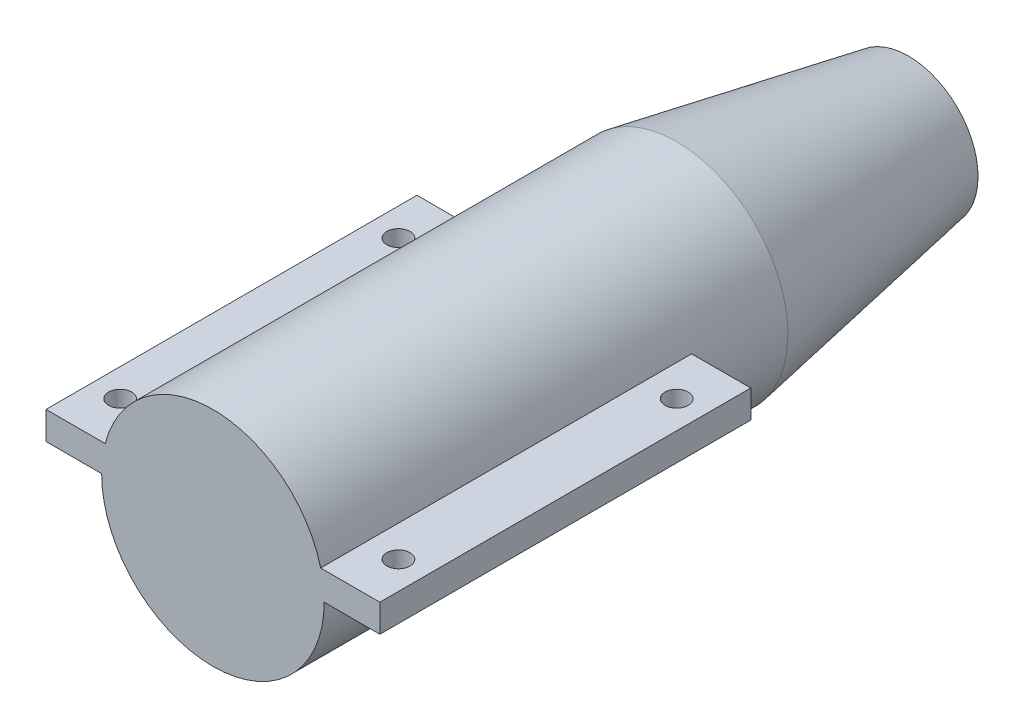
ISO-10303-21;
HEADER;
FILE_DESCRIPTION(('STEP AP214'),'2;1');
FILE_NAME('part.step','',(''),(''),'','','');
FILE_SCHEMA(('AUTOMOTIVE_DESIGN { 1 0 10303 214 1 1 1 1 }'));
ENDSEC;
DATA;
#1=APPLICATION_CONTEXT('core data for automotive mechanical design processes');
#2=APPLICATION_PROTOCOL_DEFINITION('international standard','automotive_design',2000,#1);
#3=PRODUCT_CONTEXT('',#1,'mechanical');
#4=PRODUCT('Part','Part','',(#3));
#5=PRODUCT_RELATED_PRODUCT_CATEGORY('part','',(#4));
#6=PRODUCT_DEFINITION_FORMATION('','',#4);
#7=PRODUCT_DEFINITION_CONTEXT('part definition',#1,'design');
#8=PRODUCT_DEFINITION('design','',#6,#7);
#9=PRODUCT_DEFINITION_SHAPE('','',#8);
#10=(LENGTH_UNIT() NAMED_UNIT(*) SI_UNIT(.MILLI.,.METRE.));
#11=(NAMED_UNIT(*) PLANE_ANGLE_UNIT() SI_UNIT($,.RADIAN.));
#12=(NAMED_UNIT(*) SI_UNIT($,.STERADIAN.) SOLID_ANGLE_UNIT());
#13=UNCERTAINTY_MEASURE_WITH_UNIT(LENGTH_MEASURE(1.E-05),#10,'distance_accuracy_value','');
#14=(GEOMETRIC_REPRESENTATION_CONTEXT(3) GLOBAL_UNCERTAINTY_ASSIGNED_CONTEXT((#13)) GLOBAL_UNIT_ASSIGNED_CONTEXT((#10,
#11,#12)) REPRESENTATION_CONTEXT('',''));
#15=CARTESIAN_POINT('',(0.,0.,0.));
#16=DIRECTION('',(0.,0.,1.));
#17=DIRECTION('',(1.,0.,0.));
#18=AXIS2_PLACEMENT_3D('',#15,#16,#17);
#19=CARTESIAN_POINT('',(0.,0.,70.));
#20=DIRECTION('',(0.,0.,1.));
#21=DIRECTION('',(1.,0.,0.));
#22=AXIS2_PLACEMENT_3D('',#19,#20,#21);
#23=PLANE('',#22);
#24=CARTESIAN_POINT('',(0.,15.,70.));
#25=CARTESIAN_POINT('',(-0.413936257442321,15.,70.));
#26=CARTESIAN_POINT('',(-1.23402152083851,14.9663936257442,70.));
#27=CARTESIAN_POINT('',(-2.43691479305229,14.8190378100084,70.));
#28=CARTESIAN_POINT('',(-3.6087005739705,14.5786086083354,70.));
#29=CARTESIAN_POINT('',(-10.4295331012156,12.6008302931655,70.));
#30=CARTESIAN_POINT('',(-15.,6.6229801190772,70.));
#31=CARTESIAN_POINT('',(-15.,-8.2787251488465,70.));
#32=CARTESIAN_POINT('',(-8.2787251488465,-15.,70.));
#33=CARTESIAN_POINT('',(8.2787251488465,-15.,70.));
#34=CARTESIAN_POINT('',(15.,-8.2787251488465,70.));
#35=CARTESIAN_POINT('',(15.,6.6229801190772,70.));
#36=CARTESIAN_POINT('',(10.4295331012156,12.6008302931655,70.));
#37=CARTESIAN_POINT('',(3.6087005739705,14.5786086083354,70.));
#38=CARTESIAN_POINT('',(2.4369147930523,14.8190378100084,70.));
#39=CARTESIAN_POINT('',(1.23402152083851,14.9663936257442,70.));
#40=CARTESIAN_POINT('',(0.413936257442326,15.,70.));
#41=CARTESIAN_POINT('',(0.,15.,70.));
#42=B_SPLINE_CURVE_WITH_KNOTS('',3,(#24,#25,#26,#27,#28,#29,#30,#31,#32,#33,#34,#35,#36,#37,#38,
#39,#40,#41),.UNSPECIFIED.,.T.,.F.,(4,1,1,1,1,2,2,2,1,1,1,1,4),(0.,0.0125,0.025,0.0375,0.05,
0.25,0.5,0.75,0.95,0.9625,0.975,0.9875,1.),.UNSPECIFIED.);
#43=CARTESIAN_POINT('',(0.,15.,70.));
#44=VERTEX_POINT('',#43);
#45=EDGE_CURVE('E219',#44,#44,#42,.T.);
#46=ORIENTED_EDGE('',*,*,#45,.F.);
#47=EDGE_LOOP('',(#46));
#48=FACE_BOUND('',#47,.T.);
#49=ADVANCED_FACE('F41',(#48),#23,.F.);
#50=CARTESIAN_POINT('',(0.,24.,120.));
#51=CARTESIAN_POINT('',(0.,21.,103.333333333333));
#52=CARTESIAN_POINT('',(0.,18.,86.6666666666667));
#53=CARTESIAN_POINT('',(0.,15.,70.));
#54=CARTESIAN_POINT('',(0.662298011907722,24.,120.));
#55=CARTESIAN_POINT('',(0.579510760419257,21.,103.333333333333));
#56=CARTESIAN_POINT('',(0.496723508930791,18.,86.6666666666667));
#57=CARTESIAN_POINT('',(0.413936257442326,15.,70.));
#58=CARTESIAN_POINT('',(1.97443443334161,23.9462298011908,120.));
#59=CARTESIAN_POINT('',(1.72763012917391,20.9529510760419,103.333333333333));
#60=CARTESIAN_POINT('',(1.48082582500621,17.9596723508931,86.6666666666667));
#61=CARTESIAN_POINT('',(1.23402152083851,14.9663936257442,70.));
#62=CARTESIAN_POINT('',(3.89906366888368,23.7104604960134,120.));
#63=CARTESIAN_POINT('',(3.41168071027322,20.7466529340117,103.333333333333));
#64=CARTESIAN_POINT('',(2.92429775166276,17.7828453720101,86.6666666666667));
#65=CARTESIAN_POINT('',(2.4369147930523,14.8190378100084,70.));
#66=CARTESIAN_POINT('',(5.77392091835281,23.3257737733366,120.));
#67=CARTESIAN_POINT('',(5.05218080355871,20.4100520516696,103.333333333333));
#68=CARTESIAN_POINT('',(4.3304406887646,17.4943303300025,86.6666666666667));
#69=CARTESIAN_POINT('',(3.6087005739705,14.5786086083354,70.));
#70=CARTESIAN_POINT('',(16.687252961945,20.1613284690648,120.));
#71=CARTESIAN_POINT('',(14.6013463417019,17.6411624104317,103.333333333333));
#72=CARTESIAN_POINT('',(12.5154397214588,15.1209963517986,86.6666666666667));
#73=CARTESIAN_POINT('',(10.4295331012156,12.6008302931655,70.));
#74=CARTESIAN_POINT('',(24.,10.5967681905235,120.));
#75=CARTESIAN_POINT('',(21.,9.27217216670807,103.333333333333));
#76=CARTESIAN_POINT('',(18.,7.94757614289264,86.6666666666667));
#77=CARTESIAN_POINT('',(15.,6.6229801190772,70.));
#78=CARTESIAN_POINT('',(24.,-13.2459602381544,120.));
#79=CARTESIAN_POINT('',(21.,-11.5902152083851,103.333333333333));
#80=CARTESIAN_POINT('',(18.,-9.93447017861581,86.6666666666667));
#81=CARTESIAN_POINT('',(15.,-8.2787251488465,70.));
#82=CARTESIAN_POINT('',(13.2459602381544,-24.,120.));
#83=CARTESIAN_POINT('',(11.5902152083851,-21.,103.333333333333));
#84=CARTESIAN_POINT('',(9.9344701786158,-18.,86.6666666666667));
#85=CARTESIAN_POINT('',(8.2787251488465,-15.,70.));
#86=CARTESIAN_POINT('',(-13.2459602381544,-24.,120.));
#87=CARTESIAN_POINT('',(-11.5902152083851,-21.,103.333333333333));
#88=CARTESIAN_POINT('',(-9.9344701786158,-18.,86.6666666666667));
#89=CARTESIAN_POINT('',(-8.2787251488465,-15.,70.));
#90=CARTESIAN_POINT('',(-24.,-13.2459602381544,120.));
#91=CARTESIAN_POINT('',(-21.,-11.5902152083851,103.333333333333));
#92=CARTESIAN_POINT('',(-18.,-9.9344701786158,86.6666666666667));
#93=CARTESIAN_POINT('',(-15.,-8.2787251488465,70.));
#94=CARTESIAN_POINT('',(-24.,10.5967681905235,120.));
#95=CARTESIAN_POINT('',(-21.,9.27217216670808,103.333333333333));
#96=CARTESIAN_POINT('',(-18.,7.94757614289264,86.6666666666667));
#97=CARTESIAN_POINT('',(-15.,6.6229801190772,70.));
#98=CARTESIAN_POINT('',(-16.687252961945,20.1613284690648,120.));
#99=CARTESIAN_POINT('',(-14.6013463417019,17.6411624104317,103.333333333333));
#100=CARTESIAN_POINT('',(-12.5154397214587,15.1209963517986,86.6666666666667));
#101=CARTESIAN_POINT('',(-10.4295331012156,12.6008302931655,70.));
#102=CARTESIAN_POINT('',(-5.7739209183528,23.3257737733366,120.));
#103=CARTESIAN_POINT('',(-5.0521808035587,20.4100520516696,103.333333333333));
#104=CARTESIAN_POINT('',(-4.3304406887646,17.4943303300025,86.6666666666667));
#105=CARTESIAN_POINT('',(-3.6087005739705,14.5786086083354,70.));
#106=CARTESIAN_POINT('',(-3.89906366888367,23.7104604960134,120.));
#107=CARTESIAN_POINT('',(-3.41168071027321,20.7466529340117,103.333333333333));
#108=CARTESIAN_POINT('',(-2.92429775166275,17.7828453720101,86.6666666666667));
#109=CARTESIAN_POINT('',(-2.43691479305229,14.8190378100084,70.));
#110=CARTESIAN_POINT('',(-1.97443443334161,23.9462298011908,120.));
#111=CARTESIAN_POINT('',(-1.72763012917391,20.9529510760419,103.333333333333));
#112=CARTESIAN_POINT('',(-1.48082582500621,17.9596723508931,86.6666666666667));
#113=CARTESIAN_POINT('',(-1.23402152083851,14.9663936257442,70.));
#114=CARTESIAN_POINT('',(-0.662298011907714,24.,120.));
#115=CARTESIAN_POINT('',(-0.579510760419249,21.,103.333333333333));
#116=CARTESIAN_POINT('',(-0.496723508930785,18.,86.6666666666667));
#117=CARTESIAN_POINT('',(-0.413936257442321,15.,70.));
#118=CARTESIAN_POINT('',(0.,24.,120.));
#119=CARTESIAN_POINT('',(0.,21.,103.333333333333));
#120=CARTESIAN_POINT('',(0.,18.,86.6666666666667));
#121=CARTESIAN_POINT('',(0.,15.,70.));
#122=B_SPLINE_SURFACE_WITH_KNOTS('',3,3,((#50,#51,#52,#53),(#54,#55,#56,#57),(#58,#59,#60,#61),
(#62,#63,#64,#65),(#66,#67,#68,#69),(#70,#71,#72,#73),(#74,#75,#76,#77),(#78,#79,#80,#81),(#82,
#83,#84,#85),(#86,#87,#88,#89),(#90,#91,#92,#93),(#94,#95,#96,#97),(#98,#99,#100,#101),(#102,
#103,#104,#105),(#106,#107,#108,#109),(#110,#111,#112,#113),(#114,#115,#116,#117),(#118,#119,
#120,#121)),.UNSPECIFIED.,.T.,.F.,.F.,(4,1,1,1,1,2,2,2,1,1,1,1,4),(4,4),(0.,0.0125,
0.0249999999999999,0.0375000000000001,0.05,0.25,0.5,0.75,0.95,0.9625,0.975,0.9875,1.),(0.,1.),.UNSPECIFIED.);
#123=CARTESIAN_POINT('',(0.,24.,120.));
#124=CARTESIAN_POINT('',(0.662298011907722,24.,120.));
#125=CARTESIAN_POINT('',(1.97443443334161,23.9462298011908,120.));
#126=CARTESIAN_POINT('',(3.89906366888368,23.7104604960134,120.));
#127=CARTESIAN_POINT('',(5.77392091835281,23.3257737733366,120.));
#128=CARTESIAN_POINT('',(16.687252961945,20.1613284690648,120.));
#129=CARTESIAN_POINT('',(24.,10.5967681905235,120.));
#130=CARTESIAN_POINT('',(24.,-13.2459602381544,120.));
#131=CARTESIAN_POINT('',(13.2459602381544,-24.,120.));
#132=CARTESIAN_POINT('',(-13.2459602381544,-24.,120.));
#133=CARTESIAN_POINT('',(-24.,-13.2459602381544,120.));
#134=CARTESIAN_POINT('',(-24.,10.5967681905235,120.));
#135=CARTESIAN_POINT('',(-16.687252961945,20.1613284690648,120.));
#136=CARTESIAN_POINT('',(-5.7739209183528,23.3257737733366,120.));
#137=CARTESIAN_POINT('',(-3.89906366888367,23.7104604960134,120.));
#138=CARTESIAN_POINT('',(-1.97443443334161,23.9462298011908,120.));
#139=CARTESIAN_POINT('',(-0.662298011907714,24.,120.));
#140=CARTESIAN_POINT('',(0.,24.,120.));
#141=B_SPLINE_CURVE_WITH_KNOTS('',3,(#123,#124,#125,#126,#127,#128,#129,#130,#131,#132,#133,
#134,#135,#136,#137,#138,#139,#140),.UNSPECIFIED.,.T.,.F.,(4,1,1,1,1,2,2,2,1,1,1,1,4),(0.,
0.0125,0.0249999999999999,0.0375000000000001,0.05,0.25,0.5,0.75,0.95,0.9625,0.975,0.9875,1.),.UNSPECIFIED.);
#142=CARTESIAN_POINT('',(0.,24.,120.));
#143=VERTEX_POINT('',#142);
#144=EDGE_CURVE('E169',#143,#143,#141,.F.);
#145=ORIENTED_EDGE('',*,*,#144,.F.);
#146=EDGE_LOOP('',(#145));
#147=FACE_BOUND('',#146,.T.);
#148=ORIENTED_EDGE('',*,*,#45,.T.);
#149=EDGE_LOOP('',(#148));
#150=FACE_BOUND('',#149,.T.);
#151=ADVANCED_FACE('F189',(#147,#150),#122,.T.);
#152=CARTESIAN_POINT('',(0.,0.,220.));
#153=DIRECTION('',(0.,0.,-1.));
#154=DIRECTION('',(-1.,0.,0.));
#155=AXIS2_PLACEMENT_3D('',#152,#153,#154);
#156=CYLINDRICAL_SURFACE('',#155,24.);
#157=CARTESIAN_POINT('',(0.,0.,220.));
#158=DIRECTION('',(0.,0.,1.));
#159=DIRECTION('',(1.,0.,0.));
#160=AXIS2_PLACEMENT_3D('',#157,#158,#159);
#161=CIRCLE('',#160,24.);
#162=CARTESIAN_POINT('',(23.2379000772445,6.,220.));
#163=VERTEX_POINT('',#162);
#164=CARTESIAN_POINT('',(-23.2379000772445,6.,220.));
#165=VERTEX_POINT('',#164);
#166=EDGE_CURVE('E166',#163,#165,#161,.T.);
#167=ORIENTED_EDGE('',*,*,#166,.F.);
#168=DIRECTION('',(0.,0.,-1.));
#169=VECTOR('',#168,1.);
#170=CARTESIAN_POINT('',(23.2379000772445,6.,220.));
#171=LINE('',#170,#169);
#172=CARTESIAN_POINT('',(23.2379000772445,6.,140.));
#173=VERTEX_POINT('',#172);
#174=EDGE_CURVE('E139',#163,#173,#171,.T.);
#175=ORIENTED_EDGE('',*,*,#174,.T.);
#176=CARTESIAN_POINT('',(0.,0.,140.));
#177=DIRECTION('',(0.,0.,1.));
#178=DIRECTION('',(1.,0.,0.));
#179=AXIS2_PLACEMENT_3D('',#176,#177,#178);
#180=CIRCLE('',#179,24.);
#181=CARTESIAN_POINT('',(24.,0.,140.));
#182=VERTEX_POINT('',#181);
#183=EDGE_CURVE('E11',#182,#173,#180,.T.);
#184=ORIENTED_EDGE('',*,*,#183,.F.);
#185=DIRECTION('',(0.,0.,-1.));
#186=VECTOR('',#185,1.);
#187=CARTESIAN_POINT('',(24.,0.,220.));
#188=LINE('',#187,#186);
#189=CARTESIAN_POINT('',(24.,0.,220.));
#190=VERTEX_POINT('',#189);
#191=EDGE_CURVE('E113',#182,#190,#188,.F.);
#192=ORIENTED_EDGE('',*,*,#191,.T.);
#193=CARTESIAN_POINT('',(-24.,0.,220.));
#194=VERTEX_POINT('',#193);
#195=EDGE_CURVE('E167',#194,#190,#161,.T.);
#196=ORIENTED_EDGE('',*,*,#195,.F.);
#197=DIRECTION('',(0.,0.,-1.));
#198=VECTOR('',#197,1.);
#199=CARTESIAN_POINT('',(-24.,0.,220.));
#200=LINE('',#199,#198);
#201=CARTESIAN_POINT('',(-24.,0.,140.));
#202=VERTEX_POINT('',#201);
#203=EDGE_CURVE('E159',#194,#202,#200,.T.);
#204=ORIENTED_EDGE('',*,*,#203,.T.);
#205=CARTESIAN_POINT('',(0.,0.,140.));
#206=DIRECTION('',(0.,0.,1.));
#207=DIRECTION('',(1.,0.,0.));
#208=AXIS2_PLACEMENT_3D('',#205,#206,#207);
#209=CIRCLE('',#208,24.);
#210=CARTESIAN_POINT('',(-23.2379000772445,6.,140.));
#211=VERTEX_POINT('',#210);
#212=EDGE_CURVE('E49',#211,#202,#209,.T.);
#213=ORIENTED_EDGE('',*,*,#212,.F.);
#214=DIRECTION('',(0.,0.,-1.));
#215=VECTOR('',#214,1.);
#216=CARTESIAN_POINT('',(-23.2379000772445,6.,220.));
#217=LINE('',#216,#215);
#218=EDGE_CURVE('E163',#211,#165,#217,.F.);
#219=ORIENTED_EDGE('',*,*,#218,.T.);
#220=EDGE_LOOP('',(#167,#175,#184,#192,#196,#204,#213,#219));
#221=FACE_BOUND('',#220,.T.);
#222=ORIENTED_EDGE('',*,*,#144,.T.);
#223=EDGE_LOOP('',(#222));
#224=FACE_BOUND('',#223,.T.);
#225=ADVANCED_FACE('F179',(#221,#224),#156,.T.);
#226=CARTESIAN_POINT('',(0.,0.,220.));
#227=DIRECTION('',(0.,0.,1.));
#228=DIRECTION('',(1.,0.,0.));
#229=AXIS2_PLACEMENT_3D('',#226,#227,#228);
#230=PLANE('',#229);
#231=ORIENTED_EDGE('',*,*,#195,.T.);
#232=DIRECTION('',(1.,0.,0.));
#233=VECTOR('',#232,1.);
#234=CARTESIAN_POINT('',(36.,0.,220.));
#235=LINE('',#234,#233);
#236=CARTESIAN_POINT('',(36.,0.,220.));
#237=VERTEX_POINT('',#236);
#238=EDGE_CURVE('E133',#190,#237,#235,.T.);
#239=ORIENTED_EDGE('',*,*,#238,.T.);
#240=DIRECTION('',(0.,1.,0.));
#241=VECTOR('',#240,1.);
#242=CARTESIAN_POINT('',(36.,6.,220.));
#243=LINE('',#242,#241);
#244=CARTESIAN_POINT('',(36.,6.,220.));
#245=VERTEX_POINT('',#244);
#246=EDGE_CURVE('E123',#237,#245,#243,.T.);
#247=ORIENTED_EDGE('',*,*,#246,.T.);
#248=DIRECTION('',(-1.,0.,0.));
#249=VECTOR('',#248,1.);
#250=CARTESIAN_POINT('',(36.,6.,220.));
#251=LINE('',#250,#249);
#252=EDGE_CURVE('E56',#245,#163,#251,.T.);
#253=ORIENTED_EDGE('',*,*,#252,.T.);
#254=ORIENTED_EDGE('',*,*,#166,.T.);
#255=DIRECTION('',(-1.,0.,0.));
#256=VECTOR('',#255,1.);
#257=CARTESIAN_POINT('',(-36.,6.,220.));
#258=LINE('',#257,#256);
#259=CARTESIAN_POINT('',(-36.,6.,220.));
#260=VERTEX_POINT('',#259);
#261=EDGE_CURVE('E147',#165,#260,#258,.T.);
#262=ORIENTED_EDGE('',*,*,#261,.T.);
#263=DIRECTION('',(0.,-1.,0.));
#264=VECTOR('',#263,1.);
#265=CARTESIAN_POINT('',(-36.,6.,220.));
#266=LINE('',#265,#264);
#267=CARTESIAN_POINT('',(-36.,0.,220.));
#268=VERTEX_POINT('',#267);
#269=EDGE_CURVE('E142',#260,#268,#266,.T.);
#270=ORIENTED_EDGE('',*,*,#269,.T.);
#271=DIRECTION('',(1.,0.,0.));
#272=VECTOR('',#271,1.);
#273=CARTESIAN_POINT('',(-36.,0.,220.));
#274=LINE('',#273,#272);
#275=EDGE_CURVE('E63',#268,#194,#274,.T.);
#276=ORIENTED_EDGE('',*,*,#275,.T.);
#277=EDGE_LOOP('',(#231,#239,#247,#253,#254,#262,#270,#276));
#278=FACE_BOUND('',#277,.T.);
#279=ADVANCED_FACE('F188',(#278),#230,.T.);
#280=CARTESIAN_POINT('',(-36.,6.,140.));
#281=DIRECTION('',(0.,1.,0.));
#282=DIRECTION('',(0.,0.,1.));
#283=AXIS2_PLACEMENT_3D('',#280,#281,#282);
#284=PLANE('',#283);
#285=CARTESIAN_POINT('',(-30.,6.,150.));
#286=DIRECTION('',(0.,1.,0.));
#287=DIRECTION('',(0.,0.,-1.));
#288=AXIS2_PLACEMENT_3D('',#285,#286,#287);
#289=CIRCLE('',#288,2.5);
#290=CARTESIAN_POINT('',(-30.,6.,147.5));
#291=VERTEX_POINT('',#290);
#292=EDGE_CURVE('E384',#291,#291,#289,.T.);
#293=ORIENTED_EDGE('',*,*,#292,.F.);
#294=EDGE_LOOP('',(#293));
#295=FACE_BOUND('',#294,.T.);
#296=CARTESIAN_POINT('',(-30.,6.,210.));
#297=DIRECTION('',(0.,1.,0.));
#298=DIRECTION('',(0.,0.,1.));
#299=AXIS2_PLACEMENT_3D('',#296,#297,#298);
#300=CIRCLE('',#299,2.5);
#301=CARTESIAN_POINT('',(-30.,6.,212.5));
#302=VERTEX_POINT('',#301);
#303=EDGE_CURVE('E134',#302,#302,#300,.T.);
#304=ORIENTED_EDGE('',*,*,#303,.F.);
#305=EDGE_LOOP('',(#304));
#306=FACE_BOUND('',#305,.T.);
#307=ORIENTED_EDGE('',*,*,#218,.F.);
#308=DIRECTION('',(-1.,0.,0.));
#309=VECTOR('',#308,1.);
#310=CARTESIAN_POINT('',(-36.,6.,140.));
#311=LINE('',#310,#309);
#312=CARTESIAN_POINT('',(-36.,6.,140.));
#313=VERTEX_POINT('',#312);
#314=EDGE_CURVE('E150',#211,#313,#311,.T.);
#315=ORIENTED_EDGE('',*,*,#314,.T.);
#316=DIRECTION('',(0.,0.,1.));
#317=VECTOR('',#316,1.);
#318=CARTESIAN_POINT('',(-36.,6.,140.));
#319=LINE('',#318,#317);
#320=EDGE_CURVE('E156',#313,#260,#319,.T.);
#321=ORIENTED_EDGE('',*,*,#320,.T.);
#322=ORIENTED_EDGE('',*,*,#261,.F.);
#323=EDGE_LOOP('',(#307,#315,#321,#322));
#324=FACE_BOUND('',#323,.T.);
#325=ADVANCED_FACE('F239',(#295,#306,#324),#284,.T.);
#326=CARTESIAN_POINT('',(-36.,0.,140.));
#327=DIRECTION('',(0.,-1.,0.));
#328=DIRECTION('',(0.,0.,-1.));
#329=AXIS2_PLACEMENT_3D('',#326,#327,#328);
#330=PLANE('',#329);
#331=CARTESIAN_POINT('',(-30.,0.,150.));
#332=DIRECTION('',(0.,-1.,0.));
#333=DIRECTION('',(0.,0.,-1.));
#334=AXIS2_PLACEMENT_3D('',#331,#332,#333);
#335=CIRCLE('',#334,2.5);
#336=CARTESIAN_POINT('',(-30.,0.,147.5));
#337=VERTEX_POINT('',#336);
#338=EDGE_CURVE('E381',#337,#337,#335,.F.);
#339=ORIENTED_EDGE('',*,*,#338,.T.);
#340=EDGE_LOOP('',(#339));
#341=FACE_BOUND('',#340,.T.);
#342=CARTESIAN_POINT('',(-30.,0.,210.));
#343=DIRECTION('',(0.,-1.,0.));
#344=DIRECTION('',(0.,0.,-1.));
#345=AXIS2_PLACEMENT_3D('',#342,#343,#344);
#346=CIRCLE('',#345,2.5);
#347=CARTESIAN_POINT('',(-30.,0.,207.5));
#348=VERTEX_POINT('',#347);
#349=EDGE_CURVE('E385',#348,#348,#346,.F.);
#350=ORIENTED_EDGE('',*,*,#349,.T.);
#351=EDGE_LOOP('',(#350));
#352=FACE_BOUND('',#351,.T.);
#353=ORIENTED_EDGE('',*,*,#203,.F.);
#354=ORIENTED_EDGE('',*,*,#275,.F.);
#355=DIRECTION('',(0.,0.,1.));
#356=VECTOR('',#355,1.);
#357=CARTESIAN_POINT('',(-36.,0.,140.));
#358=LINE('',#357,#356);
#359=CARTESIAN_POINT('',(-36.,0.,140.));
#360=VERTEX_POINT('',#359);
#361=EDGE_CURVE('E152',#360,#268,#358,.T.);
#362=ORIENTED_EDGE('',*,*,#361,.F.);
#363=DIRECTION('',(1.,0.,0.));
#364=VECTOR('',#363,1.);
#365=CARTESIAN_POINT('',(-36.,0.,140.));
#366=LINE('',#365,#364);
#367=EDGE_CURVE('E146',#360,#202,#366,.T.);
#368=ORIENTED_EDGE('',*,*,#367,.T.);
#369=EDGE_LOOP('',(#353,#354,#362,#368));
#370=FACE_BOUND('',#369,.T.);
#371=ADVANCED_FACE('F235',(#341,#352,#370),#330,.T.);
#372=CARTESIAN_POINT('',(-36.,6.,140.));
#373=DIRECTION('',(-1.,0.,0.));
#374=DIRECTION('',(0.,0.,1.));
#375=AXIS2_PLACEMENT_3D('',#372,#373,#374);
#376=PLANE('',#375);
#377=ORIENTED_EDGE('',*,*,#269,.F.);
#378=ORIENTED_EDGE('',*,*,#320,.F.);
#379=DIRECTION('',(0.,-1.,0.));
#380=VECTOR('',#379,1.);
#381=CARTESIAN_POINT('',(-36.,6.,140.));
#382=LINE('',#381,#380);
#383=EDGE_CURVE('E143',#313,#360,#382,.T.);
#384=ORIENTED_EDGE('',*,*,#383,.T.);
#385=ORIENTED_EDGE('',*,*,#361,.T.);
#386=EDGE_LOOP('',(#377,#378,#384,#385));
#387=FACE_BOUND('',#386,.T.);
#388=ADVANCED_FACE('F282',(#387),#376,.T.);
#389=CARTESIAN_POINT('',(0.,0.,140.));
#390=DIRECTION('',(0.,0.,1.));
#391=DIRECTION('',(1.,0.,0.));
#392=AXIS2_PLACEMENT_3D('',#389,#390,#391);
#393=PLANE('',#392);
#394=ORIENTED_EDGE('',*,*,#314,.F.);
#395=ORIENTED_EDGE('',*,*,#212,.T.);
#396=ORIENTED_EDGE('',*,*,#367,.F.);
#397=ORIENTED_EDGE('',*,*,#383,.F.);
#398=EDGE_LOOP('',(#394,#395,#396,#397));
#399=FACE_BOUND('',#398,.T.);
#400=ADVANCED_FACE('F232',(#399),#393,.F.);
#401=CARTESIAN_POINT('',(36.,6.,140.));
#402=DIRECTION('',(0.,1.,0.));
#403=DIRECTION('',(0.,0.,1.));
#404=AXIS2_PLACEMENT_3D('',#401,#402,#403);
#405=PLANE('',#404);
#406=CARTESIAN_POINT('',(30.,6.,210.));
#407=DIRECTION('',(0.,1.,0.));
#408=DIRECTION('',(0.,0.,-1.));
#409=AXIS2_PLACEMENT_3D('',#406,#407,#408);
#410=CIRCLE('',#409,2.5);
#411=CARTESIAN_POINT('',(30.,6.,207.5));
#412=VERTEX_POINT('',#411);
#413=EDGE_CURVE('E397',#412,#412,#410,.T.);
#414=ORIENTED_EDGE('',*,*,#413,.F.);
#415=EDGE_LOOP('',(#414));
#416=FACE_BOUND('',#415,.T.);
#417=CARTESIAN_POINT('',(30.,6.,150.));
#418=DIRECTION('',(0.,1.,0.));
#419=DIRECTION('',(0.,0.,1.));
#420=AXIS2_PLACEMENT_3D('',#417,#418,#419);
#421=CIRCLE('',#420,2.5);
#422=CARTESIAN_POINT('',(30.,6.,152.5));
#423=VERTEX_POINT('',#422);
#424=EDGE_CURVE('E389',#423,#423,#421,.T.);
#425=ORIENTED_EDGE('',*,*,#424,.F.);
#426=EDGE_LOOP('',(#425));
#427=FACE_BOUND('',#426,.T.);
#428=ORIENTED_EDGE('',*,*,#174,.F.);
#429=ORIENTED_EDGE('',*,*,#252,.F.);
#430=DIRECTION('',(0.,0.,1.));
#431=VECTOR('',#430,1.);
#432=CARTESIAN_POINT('',(36.,6.,140.));
#433=LINE('',#432,#431);
#434=CARTESIAN_POINT('',(36.,6.,140.));
#435=VERTEX_POINT('',#434);
#436=EDGE_CURVE('E124',#435,#245,#433,.T.);
#437=ORIENTED_EDGE('',*,*,#436,.F.);
#438=DIRECTION('',(-1.,0.,0.));
#439=VECTOR('',#438,1.);
#440=CARTESIAN_POINT('',(36.,6.,140.));
#441=LINE('',#440,#439);
#442=EDGE_CURVE('E118',#435,#173,#441,.T.);
#443=ORIENTED_EDGE('',*,*,#442,.T.);
#444=EDGE_LOOP('',(#428,#429,#437,#443));
#445=FACE_BOUND('',#444,.T.);
#446=ADVANCED_FACE('F302',(#416,#427,#445),#405,.T.);
#447=CARTESIAN_POINT('',(36.,0.,140.));
#448=DIRECTION('',(0.,-1.,0.));
#449=DIRECTION('',(0.,0.,-1.));
#450=AXIS2_PLACEMENT_3D('',#447,#448,#449);
#451=PLANE('',#450);
#452=CARTESIAN_POINT('',(30.,0.,210.));
#453=DIRECTION('',(0.,-1.,0.));
#454=DIRECTION('',(0.,0.,-1.));
#455=AXIS2_PLACEMENT_3D('',#452,#453,#454);
#456=CIRCLE('',#455,2.5);
#457=CARTESIAN_POINT('',(30.,0.,207.5));
#458=VERTEX_POINT('',#457);
#459=EDGE_CURVE('E400',#458,#458,#456,.F.);
#460=ORIENTED_EDGE('',*,*,#459,.T.);
#461=EDGE_LOOP('',(#460));
#462=FACE_BOUND('',#461,.T.);
#463=CARTESIAN_POINT('',(30.,0.,150.));
#464=DIRECTION('',(0.,-1.,0.));
#465=DIRECTION('',(0.,0.,-1.));
#466=AXIS2_PLACEMENT_3D('',#463,#464,#465);
#467=CIRCLE('',#466,2.5);
#468=CARTESIAN_POINT('',(30.,0.,147.5));
#469=VERTEX_POINT('',#468);
#470=EDGE_CURVE('E394',#469,#469,#467,.F.);
#471=ORIENTED_EDGE('',*,*,#470,.T.);
#472=EDGE_LOOP('',(#471));
#473=FACE_BOUND('',#472,.T.);
#474=ORIENTED_EDGE('',*,*,#191,.F.);
#475=DIRECTION('',(1.,0.,0.));
#476=VECTOR('',#475,1.);
#477=CARTESIAN_POINT('',(36.,0.,140.));
#478=LINE('',#477,#476);
#479=CARTESIAN_POINT('',(36.,0.,140.));
#480=VERTEX_POINT('',#479);
#481=EDGE_CURVE('E107',#182,#480,#478,.T.);
#482=ORIENTED_EDGE('',*,*,#481,.T.);
#483=DIRECTION('',(0.,0.,1.));
#484=VECTOR('',#483,1.);
#485=CARTESIAN_POINT('',(36.,0.,140.));
#486=LINE('',#485,#484);
#487=EDGE_CURVE('E110',#480,#237,#486,.T.);
#488=ORIENTED_EDGE('',*,*,#487,.T.);
#489=ORIENTED_EDGE('',*,*,#238,.F.);
#490=EDGE_LOOP('',(#474,#482,#488,#489));
#491=FACE_BOUND('',#490,.T.);
#492=ADVANCED_FACE('F109',(#462,#473,#491),#451,.T.);
#493=CARTESIAN_POINT('',(36.,6.,140.));
#494=DIRECTION('',(1.,0.,0.));
#495=DIRECTION('',(0.,0.,-1.));
#496=AXIS2_PLACEMENT_3D('',#493,#494,#495);
#497=PLANE('',#496);
#498=ORIENTED_EDGE('',*,*,#246,.F.);
#499=ORIENTED_EDGE('',*,*,#487,.F.);
#500=DIRECTION('',(0.,1.,0.));
#501=VECTOR('',#500,1.);
#502=CARTESIAN_POINT('',(36.,6.,140.));
#503=LINE('',#502,#501);
#504=EDGE_CURVE('E117',#480,#435,#503,.T.);
#505=ORIENTED_EDGE('',*,*,#504,.T.);
#506=ORIENTED_EDGE('',*,*,#436,.T.);
#507=EDGE_LOOP('',(#498,#499,#505,#506));
#508=FACE_BOUND('',#507,.T.);
#509=ADVANCED_FACE('F122',(#508),#497,.T.);
#510=CARTESIAN_POINT('',(0.,0.,140.));
#511=DIRECTION('',(0.,0.,1.));
#512=DIRECTION('',(1.,0.,0.));
#513=AXIS2_PLACEMENT_3D('',#510,#511,#512);
#514=PLANE('',#513);
#515=ORIENTED_EDGE('',*,*,#481,.F.);
#516=ORIENTED_EDGE('',*,*,#183,.T.);
#517=ORIENTED_EDGE('',*,*,#442,.F.);
#518=ORIENTED_EDGE('',*,*,#504,.F.);
#519=EDGE_LOOP('',(#515,#516,#517,#518));
#520=FACE_BOUND('',#519,.T.);
#521=ADVANCED_FACE('F127',(#520),#514,.F.);
#522=CARTESIAN_POINT('',(30.,-24.5209785294237,150.));
#523=DIRECTION('',(0.,1.,0.));
#524=DIRECTION('',(0.,0.,1.));
#525=AXIS2_PLACEMENT_3D('',#522,#523,#524);
#526=CYLINDRICAL_SURFACE('',#525,2.5);
#527=ORIENTED_EDGE('',*,*,#470,.F.);
#528=EDGE_LOOP('',(#527));
#529=FACE_BOUND('',#528,.T.);
#530=ORIENTED_EDGE('',*,*,#424,.T.);
#531=EDGE_LOOP('',(#530));
#532=FACE_BOUND('',#531,.T.);
#533=ADVANCED_FACE('F336',(#529,#532),#526,.F.);
#534=CARTESIAN_POINT('',(30.,-24.5209785294237,210.));
#535=DIRECTION('',(0.,1.,0.));
#536=DIRECTION('',(0.,0.,1.));
#537=AXIS2_PLACEMENT_3D('',#534,#535,#536);
#538=CYLINDRICAL_SURFACE('',#537,2.5);
#539=ORIENTED_EDGE('',*,*,#459,.F.);
#540=EDGE_LOOP('',(#539));
#541=FACE_BOUND('',#540,.T.);
#542=ORIENTED_EDGE('',*,*,#413,.T.);
#543=EDGE_LOOP('',(#542));
#544=FACE_BOUND('',#543,.T.);
#545=ADVANCED_FACE('F344',(#541,#544),#538,.F.);
#546=CARTESIAN_POINT('',(-30.,-24.5209785294237,210.));
#547=DIRECTION('',(0.,1.,0.));
#548=DIRECTION('',(0.,0.,1.));
#549=AXIS2_PLACEMENT_3D('',#546,#547,#548);
#550=CYLINDRICAL_SURFACE('',#549,2.5);
#551=ORIENTED_EDGE('',*,*,#349,.F.);
#552=EDGE_LOOP('',(#551));
#553=FACE_BOUND('',#552,.T.);
#554=ORIENTED_EDGE('',*,*,#303,.T.);
#555=EDGE_LOOP('',(#554));
#556=FACE_BOUND('',#555,.T.);
#557=ADVANCED_FACE('F354',(#553,#556),#550,.F.);
#558=CARTESIAN_POINT('',(-30.,-24.5209785294237,150.));
#559=DIRECTION('',(0.,1.,0.));
#560=DIRECTION('',(0.,0.,1.));
#561=AXIS2_PLACEMENT_3D('',#558,#559,#560);
#562=CYLINDRICAL_SURFACE('',#561,2.5);
#563=ORIENTED_EDGE('',*,*,#338,.F.);
#564=EDGE_LOOP('',(#563));
#565=FACE_BOUND('',#564,.T.);
#566=ORIENTED_EDGE('',*,*,#292,.T.);
#567=EDGE_LOOP('',(#566));
#568=FACE_BOUND('',#567,.T.);
#569=ADVANCED_FACE('F364',(#565,#568),#562,.F.);
#570=CLOSED_SHELL('',(#49,#151,#225,#279,#325,#371,#388,#400,#446,#492,#509,#521,#533,#545,#557,#569));
#571=MANIFOLD_SOLID_BREP('B2',#570);
#572=ADVANCED_BREP_SHAPE_REPRESENTATION('',(#18,#571),#14);
#573=SHAPE_DEFINITION_REPRESENTATION(#9,#572);
ENDSEC;
END-ISO-10303-21;
